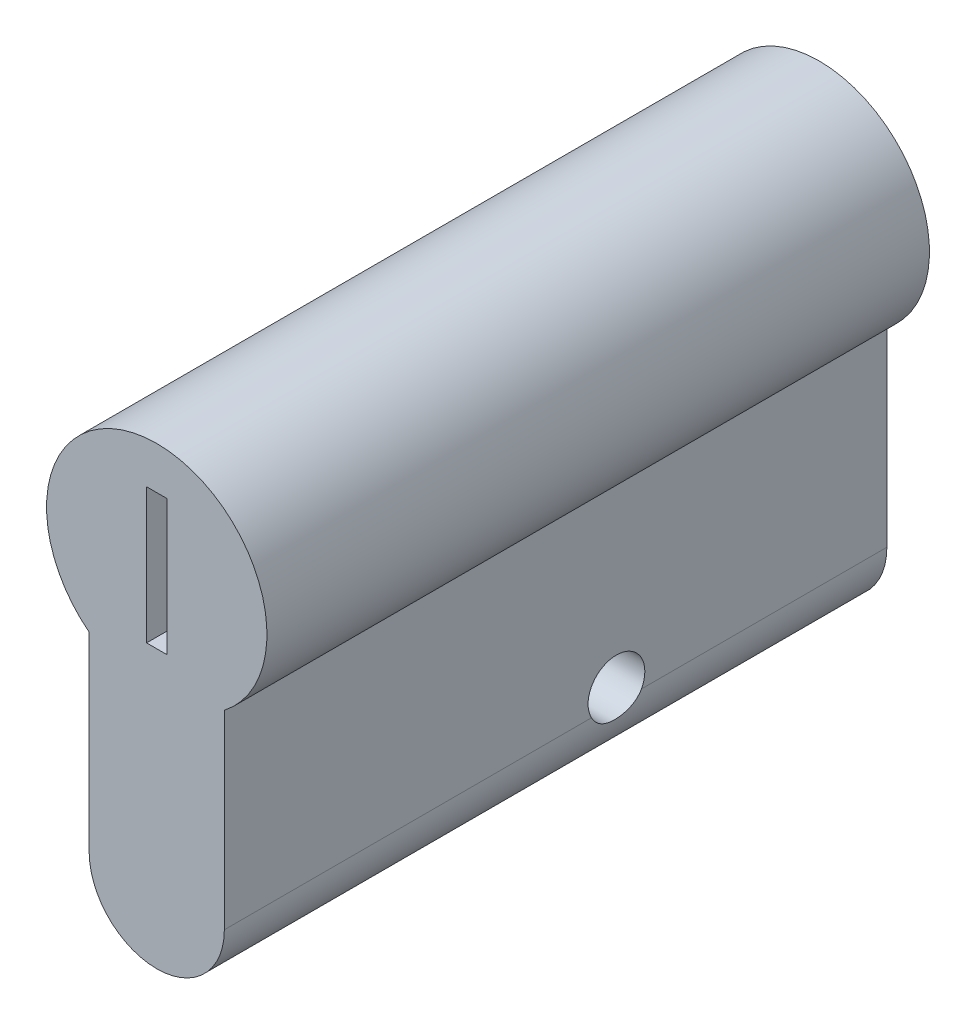
ISO-10303-21;
HEADER;
FILE_DESCRIPTION(('STEP AP214'),'2;1');
FILE_NAME('part.step','',(''),(''),'','','');
FILE_SCHEMA(('AUTOMOTIVE_DESIGN { 1 0 10303 214 1 1 1 1 }'));
ENDSEC;
DATA;
#1=APPLICATION_CONTEXT('core data for automotive mechanical design processes');
#2=APPLICATION_PROTOCOL_DEFINITION('international standard','automotive_design',2000,#1);
#3=PRODUCT_CONTEXT('',#1,'mechanical');
#4=PRODUCT('Part','Part','',(#3));
#5=PRODUCT_RELATED_PRODUCT_CATEGORY('part','',(#4));
#6=PRODUCT_DEFINITION_FORMATION('','',#4);
#7=PRODUCT_DEFINITION_CONTEXT('part definition',#1,'design');
#8=PRODUCT_DEFINITION('design','',#6,#7);
#9=PRODUCT_DEFINITION_SHAPE('','',#8);
#10=(LENGTH_UNIT() NAMED_UNIT(*) SI_UNIT(.MILLI.,.METRE.));
#11=(NAMED_UNIT(*) PLANE_ANGLE_UNIT() SI_UNIT($,.RADIAN.));
#12=(NAMED_UNIT(*) SI_UNIT($,.STERADIAN.) SOLID_ANGLE_UNIT());
#13=UNCERTAINTY_MEASURE_WITH_UNIT(LENGTH_MEASURE(1.E-05),#10,'distance_accuracy_value','');
#14=(GEOMETRIC_REPRESENTATION_CONTEXT(3) GLOBAL_UNCERTAINTY_ASSIGNED_CONTEXT((#13)) GLOBAL_UNIT_ASSIGNED_CONTEXT((#10,
#11,#12)) REPRESENTATION_CONTEXT('',''));
#15=CARTESIAN_POINT('',(0.,0.,0.));
#16=DIRECTION('',(0.,0.,1.));
#17=DIRECTION('',(1.,0.,0.));
#18=AXIS2_PLACEMENT_3D('',#15,#16,#17);
#19=CARTESIAN_POINT('',(0.,-20.5,-22.5));
#20=DIRECTION('',(0.,0.,1.));
#21=DIRECTION('',(1.,0.,0.));
#22=AXIS2_PLACEMENT_3D('',#19,#20,#21);
#23=CYLINDRICAL_SURFACE('',#22,5.);
#24=CARTESIAN_POINT('',(4.99999999999999,-20.5,-0.653381468738022));
#25=CARTESIAN_POINT('',(5.00000281437653,-20.551427904652,-0.68123007868387));
#26=CARTESIAN_POINT('',(4.99920614179341,-20.6016607901096,-0.711213765831244));
#27=CARTESIAN_POINT('',(4.99626059285936,-20.6994118956814,-0.775231838132045));
#28=CARTESIAN_POINT('',(4.9941121473047,-20.7469309753972,-0.809264929980589));
#29=CARTESIAN_POINT('',(4.98602149837199,-20.8847523420998,-0.916960957883597));
#30=CARTESIAN_POINT('',(4.97843155649713,-20.970575003575,-0.996359893594315));
#31=CARTESIAN_POINT('',(4.96107509187436,-21.1276998051607,-1.16802849904359));
#32=CARTESIAN_POINT('',(4.95130981491811,-21.199010211737,-1.26029079080309));
#33=CARTESIAN_POINT('',(4.93180993082775,-21.3254385718669,-1.45535792952646));
#34=CARTESIAN_POINT('',(4.92207533014361,-21.3805533190962,-1.55816485862995));
#35=CARTESIAN_POINT('',(4.90446505512426,-21.4739292021454,-1.77361181545553));
#36=CARTESIAN_POINT('',(4.89662706913525,-21.5118599679932,-1.88639847889596));
#37=CARTESIAN_POINT('',(4.88465424416467,-21.5681726960741,-2.11694036400927));
#38=CARTESIAN_POINT('',(4.88051887004466,-21.5865574833591,-2.23469486510378));
#39=CARTESIAN_POINT('',(4.87682521691228,-21.6030169872227,-2.46955136810873));
#40=CARTESIAN_POINT('',(4.87718584464699,-21.6014515298545,-2.58662692575963));
#41=CARTESIAN_POINT('',(4.88221538059669,-21.5789355287442,-2.81879142651727));
#42=CARTESIAN_POINT('',(4.8868839820564,-21.5579863652456,-2.93388051047924));
#43=CARTESIAN_POINT('',(4.89954702890682,-21.4976810167674,-3.15770698862414));
#44=CARTESIAN_POINT('',(4.907508553442,-21.4585065674339,-3.26649543128784));
#45=CARTESIAN_POINT('',(4.9252123576116,-21.3629212994912,-3.4761144104822));
#46=CARTESIAN_POINT('',(4.93495550225236,-21.3065020992929,-3.57694104722666));
#47=CARTESIAN_POINT('',(4.95448152912483,-21.1764130333915,-3.77025086251528));
#48=CARTESIAN_POINT('',(4.96425998642432,-21.1023696996789,-3.86248297350536));
#49=CARTESIAN_POINT('',(4.98128858078014,-20.9397741566001,-4.03326578451244));
#50=CARTESIAN_POINT('',(4.98854252112335,-20.8512440705643,-4.11183697510118));
#51=CARTESIAN_POINT('',(4.99549855841119,-20.7160261009473,-4.21285703578398));
#52=CARTESIAN_POINT('',(4.9971493570555,-20.6741719389921,-4.2418128888348));
#53=CARTESIAN_POINT('',(4.99939993061272,-20.5885110541697,-4.29658585745505));
#54=CARTESIAN_POINT('',(5.0000011184334,-20.544707037686,-4.32240714887504));
#55=CARTESIAN_POINT('',(4.99999999999999,-20.5,-4.34661853126188));
#56=B_SPLINE_CURVE_WITH_KNOTS('',3,(#24,#25,#26,#27,#28,#29,#30,#31,#32,#33,#34,#35,#36,#37,#38,
#39,#40,#41,#42,#43,#44,#45,#46,#47,#48,#49,#50,#51,#52,#53,#54,#55),.UNSPECIFIED.,.F.,.F.,(4,2,
2,2,2,2,2,2,2,2,2,2,2,2,2,4),(0.,0.175331270959057,0.350606693912863,0.700294159784513,
1.04978187580317,1.39933873486071,1.75535712505673,2.11132405161065,2.46087992375224,
2.81041090720015,3.15652884191074,3.50281527101435,3.85722128612238,4.21109103913352,
4.36373304843276,4.51616942356394),.UNSPECIFIED.);
#57=CARTESIAN_POINT('',(5.,-20.5,-0.653381468738022));
#58=VERTEX_POINT('',#57);
#59=CARTESIAN_POINT('',(4.99999999999999,-20.5,-4.34661853126189));
#60=VERTEX_POINT('',#59);
#61=EDGE_CURVE('E11',#58,#60,#56,.T.);
#62=ORIENTED_EDGE('',*,*,#61,.F.);
#63=DIRECTION('',(0.,0.,1.));
#64=VECTOR('',#63,1.);
#65=CARTESIAN_POINT('',(5.,-20.5,-22.5));
#66=LINE('',#65,#64);
#67=CARTESIAN_POINT('',(5.,-20.5,26.5));
#68=VERTEX_POINT('',#67);
#69=EDGE_CURVE('E138',#58,#68,#66,.T.);
#70=ORIENTED_EDGE('',*,*,#69,.T.);
#71=CARTESIAN_POINT('',(0.,-20.5,26.5));
#72=DIRECTION('',(0.,0.,1.));
#73=DIRECTION('',(1.,0.,0.));
#74=AXIS2_PLACEMENT_3D('',#71,#72,#73);
#75=CIRCLE('',#74,5.);
#76=CARTESIAN_POINT('',(-5.,-20.5,26.5));
#77=VERTEX_POINT('',#76);
#78=EDGE_CURVE('E126',#77,#68,#75,.T.);
#79=ORIENTED_EDGE('',*,*,#78,.F.);
#80=DIRECTION('',(0.,0.,1.));
#81=VECTOR('',#80,1.);
#82=CARTESIAN_POINT('',(-5.,-20.5,-22.5));
#83=LINE('',#82,#81);
#84=CARTESIAN_POINT('',(-5.,-20.5,-0.65338146873802));
#85=VERTEX_POINT('',#84);
#86=EDGE_CURVE('E120',#85,#77,#83,.T.);
#87=ORIENTED_EDGE('',*,*,#86,.F.);
#88=CARTESIAN_POINT('',(-5.00000000000002,-20.5,-4.34661853126189));
#89=CARTESIAN_POINT('',(-5.00000281437655,-20.551427904652,-4.31876992131603));
#90=CARTESIAN_POINT('',(-4.99920614179343,-20.6016607901096,-4.28878623416866));
#91=CARTESIAN_POINT('',(-4.99626059285939,-20.6994118956814,-4.22476816186786));
#92=CARTESIAN_POINT('',(-4.99411214730472,-20.7469309753972,-4.19073507001931));
#93=CARTESIAN_POINT('',(-4.98602149837201,-20.8847523420998,-4.08303904211631));
#94=CARTESIAN_POINT('',(-4.97843155649716,-20.970575003575,-4.00364010640559));
#95=CARTESIAN_POINT('',(-4.96107509187438,-21.1276998051607,-3.83197150095631));
#96=CARTESIAN_POINT('',(-4.95130981491814,-21.199010211737,-3.73970920919681));
#97=CARTESIAN_POINT('',(-4.93180993082778,-21.3254385718669,-3.54464207047344));
#98=CARTESIAN_POINT('',(-4.92207533014364,-21.3805533190962,-3.44183514136996));
#99=CARTESIAN_POINT('',(-4.90446505512428,-21.4739292021454,-3.22638818454437));
#100=CARTESIAN_POINT('',(-4.89662706913528,-21.5118599679932,-3.11360152110395));
#101=CARTESIAN_POINT('',(-4.8846542441647,-21.568172696074,-2.88305963599064));
#102=CARTESIAN_POINT('',(-4.88051887004469,-21.5865574833591,-2.76530513489613));
#103=CARTESIAN_POINT('',(-4.87682521691231,-21.6030169872227,-2.53044863189118));
#104=CARTESIAN_POINT('',(-4.87718584464702,-21.6014515298545,-2.41337307424027));
#105=CARTESIAN_POINT('',(-4.88221538059672,-21.5789355287442,-2.18120857348263));
#106=CARTESIAN_POINT('',(-4.88688398205643,-21.5579863652456,-2.06611948952067));
#107=CARTESIAN_POINT('',(-4.89954702890685,-21.4976810167674,-1.84229301137576));
#108=CARTESIAN_POINT('',(-4.90750855344202,-21.4585065674339,-1.73350456871206));
#109=CARTESIAN_POINT('',(-4.92521235761162,-21.3629212994912,-1.5238855895177));
#110=CARTESIAN_POINT('',(-4.93495550225239,-21.3065020992929,-1.42305895277325));
#111=CARTESIAN_POINT('',(-4.95448152912486,-21.1764130333915,-1.22974913748463));
#112=CARTESIAN_POINT('',(-4.96425998642435,-21.1023696996789,-1.13751702649454));
#113=CARTESIAN_POINT('',(-4.98128858078017,-20.9397741566001,-0.966734215487462));
#114=CARTESIAN_POINT('',(-4.98854252112337,-20.8512440705643,-0.888163024898719));
#115=CARTESIAN_POINT('',(-4.99549855841122,-20.7160261009473,-0.787142964215927));
#116=CARTESIAN_POINT('',(-4.99714935705553,-20.6741719389921,-0.758187111165103));
#117=CARTESIAN_POINT('',(-4.99939993061275,-20.5885110541697,-0.703414142544858));
#118=CARTESIAN_POINT('',(-5.00000111843342,-20.544707037686,-0.677592851124867));
#119=CARTESIAN_POINT('',(-5.00000000000002,-20.5,-0.65338146873802));
#120=B_SPLINE_CURVE_WITH_KNOTS('',3,(#88,#89,#90,#91,#92,#93,#94,#95,#96,#97,#98,#99,#100,#101,
#102,#103,#104,#105,#106,#107,#108,#109,#110,#111,#112,#113,#114,#115,#116,#117,#118,#119),
.UNSPECIFIED.,.F.,.F.,(4,2,2,2,2,2,2,2,2,2,2,2,2,2,2,4),(0.,0.175331270959063,0.350606693912865,
0.700294159784515,1.04978187580317,1.39933873486071,1.75535712505673,2.11132405161066,
2.46087992375225,2.81041090720016,3.15652884191074,3.50281527101435,3.85722128612238,
4.21109103913352,4.36373304843276,4.51616942356394),.UNSPECIFIED.);
#121=CARTESIAN_POINT('',(-5.,-20.5,-4.34661853126189));
#122=VERTEX_POINT('',#121);
#123=EDGE_CURVE('E47',#122,#85,#120,.T.);
#124=ORIENTED_EDGE('',*,*,#123,.F.);
#125=CARTESIAN_POINT('',(-5.,-20.5,-22.5));
#126=VERTEX_POINT('',#125);
#127=EDGE_CURVE('E116',#126,#122,#83,.T.);
#128=ORIENTED_EDGE('',*,*,#127,.F.);
#129=CARTESIAN_POINT('',(0.,-20.5,-22.5));
#130=DIRECTION('',(0.,0.,1.));
#131=DIRECTION('',(1.,0.,0.));
#132=AXIS2_PLACEMENT_3D('',#129,#130,#131);
#133=CIRCLE('',#132,5.);
#134=CARTESIAN_POINT('',(5.,-20.5,-22.5));
#135=VERTEX_POINT('',#134);
#136=EDGE_CURVE('E253',#126,#135,#133,.T.);
#137=ORIENTED_EDGE('',*,*,#136,.T.);
#138=EDGE_CURVE('E136',#135,#60,#66,.T.);
#139=ORIENTED_EDGE('',*,*,#138,.T.);
#140=EDGE_LOOP('',(#62,#70,#79,#87,#124,#128,#137,#139));
#141=FACE_BOUND('',#140,.T.);
#142=ADVANCED_FACE('F35',(#141),#23,.T.);
#143=CARTESIAN_POINT('',(-5.00000000000002,-6.43603138587747,-22.5));
#144=DIRECTION('',(-1.,0.,0.));
#145=DIRECTION('',(0.,-1.,0.));
#146=AXIS2_PLACEMENT_3D('',#143,#144,#145);
#147=PLANE('',#146);
#148=CARTESIAN_POINT('',(-5.,-19.5,-2.49999999999995));
#149=DIRECTION('',(-1.,0.,0.));
#150=DIRECTION('',(0.,0.,1.));
#151=AXIS2_PLACEMENT_3D('',#148,#149,#150);
#152=CIRCLE('',#151,2.1);
#153=EDGE_CURVE('E53',#85,#122,#152,.T.);
#154=ORIENTED_EDGE('',*,*,#153,.F.);
#155=ORIENTED_EDGE('',*,*,#86,.T.);
#156=DIRECTION('',(0.,-1.,0.));
#157=VECTOR('',#156,1.);
#158=CARTESIAN_POINT('',(-5.00000000000002,-6.43603138587747,26.5));
#159=LINE('',#158,#157);
#160=CARTESIAN_POINT('',(-5.00000000000002,-6.43603138587747,26.5));
#161=VERTEX_POINT('',#160);
#162=EDGE_CURVE('E275',#161,#77,#159,.T.);
#163=ORIENTED_EDGE('',*,*,#162,.F.);
#164=DIRECTION('',(0.,0.,1.));
#165=VECTOR('',#164,1.);
#166=CARTESIAN_POINT('',(-5.00000000000002,-6.43603138587747,-22.5));
#167=LINE('',#166,#165);
#168=CARTESIAN_POINT('',(-5.00000000000002,-6.43603138587747,-22.5));
#169=VERTEX_POINT('',#168);
#170=EDGE_CURVE('E127',#169,#161,#167,.T.);
#171=ORIENTED_EDGE('',*,*,#170,.F.);
#172=DIRECTION('',(0.,-1.,0.));
#173=VECTOR('',#172,1.);
#174=CARTESIAN_POINT('',(-5.00000000000002,-6.43603138587747,-22.5));
#175=LINE('',#174,#173);
#176=EDGE_CURVE('E132',#169,#126,#175,.T.);
#177=ORIENTED_EDGE('',*,*,#176,.T.);
#178=ORIENTED_EDGE('',*,*,#127,.T.);
#179=EDGE_LOOP('',(#154,#155,#163,#171,#177,#178));
#180=FACE_BOUND('',#179,.T.);
#181=ADVANCED_FACE('F118',(#180),#147,.T.);
#182=CARTESIAN_POINT('',(0.,0.,-22.5));
#183=DIRECTION('',(0.,0.,1.));
#184=DIRECTION('',(1.,0.,0.));
#185=AXIS2_PLACEMENT_3D('',#182,#183,#184);
#186=CYLINDRICAL_SURFACE('',#185,8.15);
#187=ORIENTED_EDGE('',*,*,#170,.T.);
#188=CARTESIAN_POINT('',(0.,0.,26.5));
#189=DIRECTION('',(0.,0.,1.));
#190=DIRECTION('',(1.,0.,0.));
#191=AXIS2_PLACEMENT_3D('',#188,#189,#190);
#192=CIRCLE('',#191,8.15);
#193=CARTESIAN_POINT('',(5.00000000000002,-6.43603138587747,26.5));
#194=VERTEX_POINT('',#193);
#195=EDGE_CURVE('E272',#194,#161,#192,.T.);
#196=ORIENTED_EDGE('',*,*,#195,.F.);
#197=DIRECTION('',(0.,0.,1.));
#198=VECTOR('',#197,1.);
#199=CARTESIAN_POINT('',(5.00000000000002,-6.43603138587747,-22.5));
#200=LINE('',#199,#198);
#201=CARTESIAN_POINT('',(5.00000000000002,-6.43603138587747,-22.5));
#202=VERTEX_POINT('',#201);
#203=EDGE_CURVE('E129',#202,#194,#200,.T.);
#204=ORIENTED_EDGE('',*,*,#203,.F.);
#205=CARTESIAN_POINT('',(0.,0.,-22.5));
#206=DIRECTION('',(0.,0.,1.));
#207=DIRECTION('',(1.,0.,0.));
#208=AXIS2_PLACEMENT_3D('',#205,#206,#207);
#209=CIRCLE('',#208,8.15);
#210=EDGE_CURVE('E259',#202,#169,#209,.T.);
#211=ORIENTED_EDGE('',*,*,#210,.T.);
#212=EDGE_LOOP('',(#187,#196,#204,#211));
#213=FACE_BOUND('',#212,.T.);
#214=ADVANCED_FACE('F173',(#213),#186,.T.);
#215=CARTESIAN_POINT('',(5.,-20.5,-22.5));
#216=DIRECTION('',(1.,0.,0.));
#217=DIRECTION('',(0.,1.,0.));
#218=AXIS2_PLACEMENT_3D('',#215,#216,#217);
#219=PLANE('',#218);
#220=CARTESIAN_POINT('',(5.,-19.5,-2.49999999999995));
#221=DIRECTION('',(1.,0.,0.));
#222=DIRECTION('',(0.,1.,0.));
#223=AXIS2_PLACEMENT_3D('',#220,#221,#222);
#224=CIRCLE('',#223,2.1);
#225=EDGE_CURVE('E59',#60,#58,#224,.T.);
#226=ORIENTED_EDGE('',*,*,#225,.F.);
#227=ORIENTED_EDGE('',*,*,#138,.F.);
#228=DIRECTION('',(0.,1.,0.));
#229=VECTOR('',#228,1.);
#230=CARTESIAN_POINT('',(5.,-20.5,-22.5));
#231=LINE('',#230,#229);
#232=EDGE_CURVE('E256',#135,#202,#231,.T.);
#233=ORIENTED_EDGE('',*,*,#232,.T.);
#234=ORIENTED_EDGE('',*,*,#203,.T.);
#235=DIRECTION('',(0.,1.,0.));
#236=VECTOR('',#235,1.);
#237=CARTESIAN_POINT('',(5.,-20.5,26.5));
#238=LINE('',#237,#236);
#239=EDGE_CURVE('E269',#68,#194,#238,.T.);
#240=ORIENTED_EDGE('',*,*,#239,.F.);
#241=ORIENTED_EDGE('',*,*,#69,.F.);
#242=EDGE_LOOP('',(#226,#227,#233,#234,#240,#241));
#243=FACE_BOUND('',#242,.T.);
#244=ADVANCED_FACE('F169',(#243),#219,.T.);
#245=CARTESIAN_POINT('',(0.,-20.5,-22.5));
#246=DIRECTION('',(0.,0.,1.));
#247=DIRECTION('',(1.,0.,0.));
#248=AXIS2_PLACEMENT_3D('',#245,#246,#247);
#249=PLANE('',#248);
#250=DIRECTION('',(1.,0.,0.));
#251=VECTOR('',#250,1.);
#252=CARTESIAN_POINT('',(-0.749999999999999,-5.,-22.5));
#253=LINE('',#252,#251);
#254=CARTESIAN_POINT('',(-0.749999999999999,-5.,-22.5));
#255=VERTEX_POINT('',#254);
#256=CARTESIAN_POINT('',(0.750000000000001,-5.,-22.5));
#257=VERTEX_POINT('',#256);
#258=EDGE_CURVE('E294',#255,#257,#253,.T.);
#259=ORIENTED_EDGE('',*,*,#258,.T.);
#260=DIRECTION('',(0.,1.,0.));
#261=VECTOR('',#260,1.);
#262=CARTESIAN_POINT('',(0.750000000000001,-5.,-22.5));
#263=LINE('',#262,#261);
#264=CARTESIAN_POINT('',(0.749999999999999,5.,-22.5));
#265=VERTEX_POINT('',#264);
#266=EDGE_CURVE('E285',#257,#265,#263,.T.);
#267=ORIENTED_EDGE('',*,*,#266,.T.);
#268=DIRECTION('',(-1.,0.,0.));
#269=VECTOR('',#268,1.);
#270=CARTESIAN_POINT('',(0.749999999999999,5.,-22.5));
#271=LINE('',#270,#269);
#272=CARTESIAN_POINT('',(-0.750000000000001,5.,-22.5));
#273=VERTEX_POINT('',#272);
#274=EDGE_CURVE('E288',#265,#273,#271,.T.);
#275=ORIENTED_EDGE('',*,*,#274,.T.);
#276=DIRECTION('',(0.,-1.,0.));
#277=VECTOR('',#276,1.);
#278=CARTESIAN_POINT('',(-0.750000000000001,5.,-22.5));
#279=LINE('',#278,#277);
#280=EDGE_CURVE('E291',#273,#255,#279,.T.);
#281=ORIENTED_EDGE('',*,*,#280,.T.);
#282=EDGE_LOOP('',(#259,#267,#275,#281));
#283=FACE_BOUND('',#282,.T.);
#284=ORIENTED_EDGE('',*,*,#136,.F.);
#285=ORIENTED_EDGE('',*,*,#176,.F.);
#286=ORIENTED_EDGE('',*,*,#210,.F.);
#287=ORIENTED_EDGE('',*,*,#232,.F.);
#288=EDGE_LOOP('',(#284,#285,#286,#287));
#289=FACE_BOUND('',#288,.T.);
#290=ADVANCED_FACE('F165',(#283,#289),#249,.F.);
#291=CARTESIAN_POINT('',(0.750000000000001,-5.,-22.5));
#292=DIRECTION('',(1.,0.,0.));
#293=DIRECTION('',(0.,1.,0.));
#294=AXIS2_PLACEMENT_3D('',#291,#292,#293);
#295=PLANE('',#294);
#296=DIRECTION('',(0.,0.,1.));
#297=VECTOR('',#296,1.);
#298=CARTESIAN_POINT('',(0.750000000000001,-5.,-22.5));
#299=LINE('',#298,#297);
#300=CARTESIAN_POINT('',(0.750000000000001,-5.,26.5));
#301=VERTEX_POINT('',#300);
#302=EDGE_CURVE('E257',#257,#301,#299,.T.);
#303=ORIENTED_EDGE('',*,*,#302,.T.);
#304=DIRECTION('',(0.,1.,0.));
#305=VECTOR('',#304,1.);
#306=CARTESIAN_POINT('',(0.750000000000001,-5.,26.5));
#307=LINE('',#306,#305);
#308=CARTESIAN_POINT('',(0.749999999999999,5.,26.5));
#309=VERTEX_POINT('',#308);
#310=EDGE_CURVE('E249',#301,#309,#307,.T.);
#311=ORIENTED_EDGE('',*,*,#310,.T.);
#312=DIRECTION('',(0.,0.,1.));
#313=VECTOR('',#312,1.);
#314=CARTESIAN_POINT('',(0.749999999999999,5.,-22.5));
#315=LINE('',#314,#313);
#316=EDGE_CURVE('E264',#265,#309,#315,.T.);
#317=ORIENTED_EDGE('',*,*,#316,.F.);
#318=ORIENTED_EDGE('',*,*,#266,.F.);
#319=EDGE_LOOP('',(#303,#311,#317,#318));
#320=FACE_BOUND('',#319,.T.);
#321=ADVANCED_FACE('F155',(#320),#295,.F.);
#322=CARTESIAN_POINT('',(-0.749999999999999,-5.,-22.5));
#323=DIRECTION('',(0.,-1.,0.));
#324=DIRECTION('',(0.,0.,-1.));
#325=AXIS2_PLACEMENT_3D('',#322,#323,#324);
#326=PLANE('',#325);
#327=DIRECTION('',(0.,0.,1.));
#328=VECTOR('',#327,1.);
#329=CARTESIAN_POINT('',(-0.749999999999999,-5.,-22.5));
#330=LINE('',#329,#328);
#331=CARTESIAN_POINT('',(-0.749999999999999,-5.,26.5));
#332=VERTEX_POINT('',#331);
#333=EDGE_CURVE('E261',#255,#332,#330,.T.);
#334=ORIENTED_EDGE('',*,*,#333,.T.);
#335=DIRECTION('',(1.,0.,0.));
#336=VECTOR('',#335,1.);
#337=CARTESIAN_POINT('',(-0.749999999999999,-5.,26.5));
#338=LINE('',#337,#336);
#339=EDGE_CURVE('E276',#332,#301,#338,.T.);
#340=ORIENTED_EDGE('',*,*,#339,.T.);
#341=ORIENTED_EDGE('',*,*,#302,.F.);
#342=ORIENTED_EDGE('',*,*,#258,.F.);
#343=EDGE_LOOP('',(#334,#340,#341,#342));
#344=FACE_BOUND('',#343,.T.);
#345=ADVANCED_FACE('F151',(#344),#326,.F.);
#346=CARTESIAN_POINT('',(-0.750000000000001,5.,-22.5));
#347=DIRECTION('',(-1.,0.,0.));
#348=DIRECTION('',(0.,-1.,0.));
#349=AXIS2_PLACEMENT_3D('',#346,#347,#348);
#350=PLANE('',#349);
#351=DIRECTION('',(0.,0.,1.));
#352=VECTOR('',#351,1.);
#353=CARTESIAN_POINT('',(-0.750000000000001,5.,-22.5));
#354=LINE('',#353,#352);
#355=CARTESIAN_POINT('',(-0.750000000000001,5.,26.5));
#356=VERTEX_POINT('',#355);
#357=EDGE_CURVE('E297',#273,#356,#354,.T.);
#358=ORIENTED_EDGE('',*,*,#357,.T.);
#359=DIRECTION('',(0.,-1.,0.));
#360=VECTOR('',#359,1.);
#361=CARTESIAN_POINT('',(-0.750000000000001,5.,26.5));
#362=LINE('',#361,#360);
#363=EDGE_CURVE('E279',#356,#332,#362,.T.);
#364=ORIENTED_EDGE('',*,*,#363,.T.);
#365=ORIENTED_EDGE('',*,*,#333,.F.);
#366=ORIENTED_EDGE('',*,*,#280,.F.);
#367=EDGE_LOOP('',(#358,#364,#365,#366));
#368=FACE_BOUND('',#367,.T.);
#369=ADVANCED_FACE('F154',(#368),#350,.F.);
#370=CARTESIAN_POINT('',(0.749999999999999,5.,-22.5));
#371=DIRECTION('',(0.,1.,0.));
#372=DIRECTION('',(0.,0.,1.));
#373=AXIS2_PLACEMENT_3D('',#370,#371,#372);
#374=PLANE('',#373);
#375=ORIENTED_EDGE('',*,*,#316,.T.);
#376=DIRECTION('',(-1.,0.,0.));
#377=VECTOR('',#376,1.);
#378=CARTESIAN_POINT('',(0.749999999999999,5.,26.5));
#379=LINE('',#378,#377);
#380=EDGE_CURVE('E304',#309,#356,#379,.T.);
#381=ORIENTED_EDGE('',*,*,#380,.T.);
#382=ORIENTED_EDGE('',*,*,#357,.F.);
#383=ORIENTED_EDGE('',*,*,#274,.F.);
#384=EDGE_LOOP('',(#375,#381,#382,#383));
#385=FACE_BOUND('',#384,.T.);
#386=ADVANCED_FACE('F149',(#385),#374,.F.);
#387=CARTESIAN_POINT('',(0.,-20.5,26.5));
#388=DIRECTION('',(0.,0.,1.));
#389=DIRECTION('',(1.,0.,0.));
#390=AXIS2_PLACEMENT_3D('',#387,#388,#389);
#391=PLANE('',#390);
#392=ORIENTED_EDGE('',*,*,#78,.T.);
#393=ORIENTED_EDGE('',*,*,#239,.T.);
#394=ORIENTED_EDGE('',*,*,#195,.T.);
#395=ORIENTED_EDGE('',*,*,#162,.T.);
#396=EDGE_LOOP('',(#392,#393,#394,#395));
#397=FACE_BOUND('',#396,.T.);
#398=ORIENTED_EDGE('',*,*,#380,.F.);
#399=ORIENTED_EDGE('',*,*,#310,.F.);
#400=ORIENTED_EDGE('',*,*,#339,.F.);
#401=ORIENTED_EDGE('',*,*,#363,.F.);
#402=EDGE_LOOP('',(#398,#399,#400,#401));
#403=FACE_BOUND('',#402,.T.);
#404=ADVANCED_FACE('F145',(#397,#403),#391,.T.);
#405=CARTESIAN_POINT('',(-5.,-19.5,-2.49999999999995));
#406=DIRECTION('',(-1.,0.,0.));
#407=DIRECTION('',(0.,0.,1.));
#408=AXIS2_PLACEMENT_3D('',#405,#406,#407);
#409=CYLINDRICAL_SURFACE('',#408,2.1);
#410=ORIENTED_EDGE('',*,*,#225,.T.);
#411=ORIENTED_EDGE('',*,*,#61,.T.);
#412=EDGE_LOOP('',(#410,#411));
#413=FACE_BOUND('',#412,.T.);
#414=ORIENTED_EDGE('',*,*,#123,.T.);
#415=ORIENTED_EDGE('',*,*,#153,.T.);
#416=EDGE_LOOP('',(#414,#415));
#417=FACE_BOUND('',#416,.T.);
#418=ADVANCED_FACE('F112',(#413,#417),#409,.F.);
#419=CLOSED_SHELL('',(#142,#181,#214,#244,#290,#321,#345,#369,#386,#404,#418));
#420=MANIFOLD_SOLID_BREP('B2',#419);
#421=ADVANCED_BREP_SHAPE_REPRESENTATION('',(#18,#420),#14);
#422=SHAPE_DEFINITION_REPRESENTATION(#9,#421);
ENDSEC;
END-ISO-10303-21;
